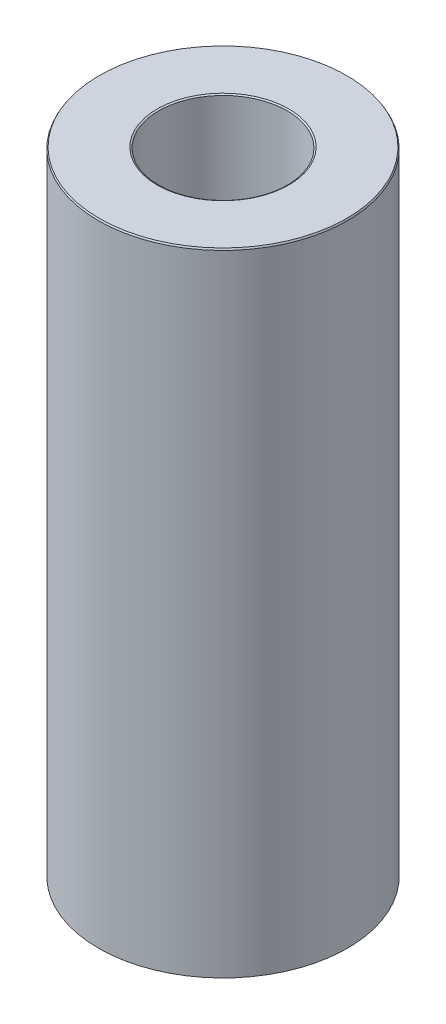
ISO-10303-21;
HEADER;
FILE_DESCRIPTION(('STEP AP214'),'2;1');
FILE_NAME('part.step','',(''),(''),'','','');
FILE_SCHEMA(('AUTOMOTIVE_DESIGN { 1 0 10303 214 1 1 1 1 }'));
ENDSEC;
DATA;
#1=APPLICATION_CONTEXT('core data for automotive mechanical design processes');
#2=APPLICATION_PROTOCOL_DEFINITION('international standard','automotive_design',2000,#1);
#3=PRODUCT_CONTEXT('',#1,'mechanical');
#4=PRODUCT('Part','Part','',(#3));
#5=PRODUCT_RELATED_PRODUCT_CATEGORY('part','',(#4));
#6=PRODUCT_DEFINITION_FORMATION('','',#4);
#7=PRODUCT_DEFINITION_CONTEXT('part definition',#1,'design');
#8=PRODUCT_DEFINITION('design','',#6,#7);
#9=PRODUCT_DEFINITION_SHAPE('','',#8);
#10=(LENGTH_UNIT() NAMED_UNIT(*) SI_UNIT(.MILLI.,.METRE.));
#11=(NAMED_UNIT(*) PLANE_ANGLE_UNIT() SI_UNIT($,.RADIAN.));
#12=(NAMED_UNIT(*) SI_UNIT($,.STERADIAN.) SOLID_ANGLE_UNIT());
#13=UNCERTAINTY_MEASURE_WITH_UNIT(LENGTH_MEASURE(1.E-05),#10,'distance_accuracy_value','');
#14=(GEOMETRIC_REPRESENTATION_CONTEXT(3) GLOBAL_UNCERTAINTY_ASSIGNED_CONTEXT((#13)) GLOBAL_UNIT_ASSIGNED_CONTEXT((#10,
#11,#12)) REPRESENTATION_CONTEXT('',''));
#15=CARTESIAN_POINT('',(0.,0.,0.));
#16=DIRECTION('',(0.,0.,1.));
#17=DIRECTION('',(1.,0.,0.));
#18=AXIS2_PLACEMENT_3D('',#15,#16,#17);
#19=CARTESIAN_POINT('',(0.,177.647973817845,0.));
#20=DIRECTION('',(0.,-1.,0.));
#21=DIRECTION('',(0.,0.,-1.));
#22=AXIS2_PLACEMENT_3D('',#19,#20,#21);
#23=CYLINDRICAL_SURFACE('',#22,35.);
#24=CARTESIAN_POINT('',(0.,0.248312626181579,0.));
#25=DIRECTION('',(0.,1.,0.));
#26=DIRECTION('',(0.,0.,1.));
#27=AXIS2_PLACEMENT_3D('',#24,#25,#26);
#28=CIRCLE('',#27,35.);
#29=CARTESIAN_POINT('',(0.,0.248312626181579,35.));
#30=VERTEX_POINT('',#29);
#31=EDGE_CURVE('E10',#30,#30,#28,.T.);
#32=ORIENTED_EDGE('',*,*,#31,.T.);
#33=EDGE_LOOP('',(#32));
#34=FACE_BOUND('',#33,.T.);
#35=CARTESIAN_POINT('',(0.,177.217883733138,0.));
#36=DIRECTION('',(0.,1.,0.));
#37=DIRECTION('',(0.,0.,1.));
#38=AXIS2_PLACEMENT_3D('',#35,#36,#37);
#39=CIRCLE('',#38,35.);
#40=CARTESIAN_POINT('',(0.,177.217883733138,35.));
#41=VERTEX_POINT('',#40);
#42=EDGE_CURVE('E50',#41,#41,#39,.F.);
#43=ORIENTED_EDGE('',*,*,#42,.T.);
#44=EDGE_LOOP('',(#43));
#45=FACE_BOUND('',#44,.T.);
#46=ADVANCED_FACE('F39',(#34,#45),#23,.T.);
#47=CARTESIAN_POINT('',(0.,177.647973817845,0.));
#48=DIRECTION('',(0.,1.,0.));
#49=DIRECTION('',(0.,0.,1.));
#50=AXIS2_PLACEMENT_3D('',#47,#48,#49);
#51=PLANE('',#50);
#52=CARTESIAN_POINT('',(0.,177.647973817845,0.));
#53=DIRECTION('',(0.,1.,0.));
#54=DIRECTION('',(0.,0.,1.));
#55=AXIS2_PLACEMENT_3D('',#52,#53,#54);
#56=CIRCLE('',#55,18.5058629531211);
#57=CARTESIAN_POINT('',(0.,177.647973817845,18.5058629531211));
#58=VERTEX_POINT('',#57);
#59=EDGE_CURVE('E58',#58,#58,#56,.F.);
#60=ORIENTED_EDGE('',*,*,#59,.T.);
#61=EDGE_LOOP('',(#60));
#62=FACE_BOUND('',#61,.T.);
#63=CARTESIAN_POINT('',(0.,177.647973817845,0.));
#64=DIRECTION('',(0.,1.,0.));
#65=DIRECTION('',(0.,0.,1.));
#66=AXIS2_PLACEMENT_3D('',#63,#64,#65);
#67=CIRCLE('',#66,34.7516873738184);
#68=CARTESIAN_POINT('',(0.,177.647973817845,34.7516873738184));
#69=VERTEX_POINT('',#68);
#70=EDGE_CURVE('E61',#69,#69,#67,.T.);
#71=ORIENTED_EDGE('',*,*,#70,.T.);
#72=EDGE_LOOP('',(#71));
#73=FACE_BOUND('',#72,.T.);
#74=ADVANCED_FACE('F88',(#62,#73),#51,.T.);
#75=CARTESIAN_POINT('',(0.,0.,0.));
#76=DIRECTION('',(0.,1.,0.));
#77=DIRECTION('',(0.,0.,1.));
#78=AXIS2_PLACEMENT_3D('',#75,#76,#77);
#79=PLANE('',#78);
#80=CARTESIAN_POINT('',(0.,0.,0.));
#81=DIRECTION('',(0.,1.,0.));
#82=DIRECTION('',(0.,0.,1.));
#83=AXIS2_PLACEMENT_3D('',#80,#81,#82);
#84=CIRCLE('',#83,18.3240854945952);
#85=CARTESIAN_POINT('',(0.,0.,18.3240854945952));
#86=VERTEX_POINT('',#85);
#87=EDGE_CURVE('E51',#86,#86,#84,.T.);
#88=ORIENTED_EDGE('',*,*,#87,.T.);
#89=EDGE_LOOP('',(#88));
#90=FACE_BOUND('',#89,.T.);
#91=CARTESIAN_POINT('',(0.,0.,0.));
#92=DIRECTION('',(0.,1.,0.));
#93=DIRECTION('',(0.,0.,1.));
#94=AXIS2_PLACEMENT_3D('',#91,#92,#93);
#95=CIRCLE('',#94,34.5699099152926);
#96=CARTESIAN_POINT('',(0.,0.,34.5699099152926));
#97=VERTEX_POINT('',#96);
#98=EDGE_CURVE('E54',#97,#97,#95,.F.);
#99=ORIENTED_EDGE('',*,*,#98,.T.);
#100=EDGE_LOOP('',(#99));
#101=FACE_BOUND('',#100,.T.);
#102=ADVANCED_FACE('F83',(#90,#101),#79,.F.);
#103=CARTESIAN_POINT('',(0.,177.647973817845,0.));
#104=DIRECTION('',(0.,-1.,0.));
#105=DIRECTION('',(0.,0.,-1.));
#106=AXIS2_PLACEMENT_3D('',#103,#104,#105);
#107=CYLINDRICAL_SURFACE('',#106,18.0757728684136);
#108=CARTESIAN_POINT('',(0.,177.399661191664,0.));
#109=DIRECTION('',(0.,1.,0.));
#110=DIRECTION('',(0.,0.,1.));
#111=AXIS2_PLACEMENT_3D('',#108,#109,#110);
#112=CIRCLE('',#111,18.0757728684136);
#113=CARTESIAN_POINT('',(0.,177.399661191664,18.0757728684136));
#114=VERTEX_POINT('',#113);
#115=EDGE_CURVE('E67',#114,#114,#112,.T.);
#116=ORIENTED_EDGE('',*,*,#115,.T.);
#117=EDGE_LOOP('',(#116));
#118=FACE_BOUND('',#117,.T.);
#119=CARTESIAN_POINT('',(0.,0.430090084707374,0.));
#120=DIRECTION('',(0.,1.,0.));
#121=DIRECTION('',(0.,0.,1.));
#122=AXIS2_PLACEMENT_3D('',#119,#120,#121);
#123=CIRCLE('',#122,18.0757728684136);
#124=CARTESIAN_POINT('',(0.,0.430090084707374,18.0757728684136));
#125=VERTEX_POINT('',#124);
#126=EDGE_CURVE('E69',#125,#125,#123,.F.);
#127=ORIENTED_EDGE('',*,*,#126,.T.);
#128=EDGE_LOOP('',(#127));
#129=FACE_BOUND('',#128,.T.);
#130=ADVANCED_FACE('F71',(#118,#129),#107,.F.);
#131=CARTESIAN_POINT('',(0.,177.399661191664,0.));
#132=DIRECTION('',(0.,1.,0.));
#133=DIRECTION('',(0.,0.,1.));
#134=AXIS2_PLACEMENT_3D('',#131,#132,#133);
#135=CONICAL_SURFACE('',#134,18.0757728684136,1.04719755119658);
#136=ORIENTED_EDGE('',*,*,#59,.F.);
#137=EDGE_LOOP('',(#136));
#138=FACE_BOUND('',#137,.T.);
#139=ORIENTED_EDGE('',*,*,#115,.F.);
#140=EDGE_LOOP('',(#139));
#141=FACE_BOUND('',#140,.T.);
#142=ADVANCED_FACE('F77',(#138,#141),#135,.F.);
#143=CARTESIAN_POINT('',(0.,0.,0.));
#144=DIRECTION('',(0.,-1.,0.));
#145=DIRECTION('',(0.,0.,-1.));
#146=AXIS2_PLACEMENT_3D('',#143,#144,#145);
#147=CONICAL_SURFACE('',#146,18.3240854945952,0.52359877559829);
#148=ORIENTED_EDGE('',*,*,#126,.F.);
#149=EDGE_LOOP('',(#148));
#150=FACE_BOUND('',#149,.T.);
#151=ORIENTED_EDGE('',*,*,#87,.F.);
#152=EDGE_LOOP('',(#151));
#153=FACE_BOUND('',#152,.T.);
#154=ADVANCED_FACE('F73',(#150,#153),#147,.F.);
#155=CARTESIAN_POINT('',(0.,0.248312626181579,0.));
#156=DIRECTION('',(0.,1.,0.));
#157=DIRECTION('',(0.,0.,1.));
#158=AXIS2_PLACEMENT_3D('',#155,#156,#157);
#159=CONICAL_SURFACE('',#158,35.,1.04719755119663);
#160=ORIENTED_EDGE('',*,*,#98,.F.);
#161=EDGE_LOOP('',(#160));
#162=FACE_BOUND('',#161,.T.);
#163=ORIENTED_EDGE('',*,*,#31,.F.);
#164=EDGE_LOOP('',(#163));
#165=FACE_BOUND('',#164,.T.);
#166=ADVANCED_FACE('F76',(#162,#165),#159,.T.);
#167=CARTESIAN_POINT('',(0.,177.647973817845,0.));
#168=DIRECTION('',(0.,-1.,0.));
#169=DIRECTION('',(0.,0.,-1.));
#170=AXIS2_PLACEMENT_3D('',#167,#168,#169);
#171=CONICAL_SURFACE('',#170,34.7516873738184,0.523598775598286);
#172=ORIENTED_EDGE('',*,*,#42,.F.);
#173=EDGE_LOOP('',(#172));
#174=FACE_BOUND('',#173,.T.);
#175=ORIENTED_EDGE('',*,*,#70,.F.);
#176=EDGE_LOOP('',(#175));
#177=FACE_BOUND('',#176,.T.);
#178=ADVANCED_FACE('F45',(#174,#177),#171,.T.);
#179=CLOSED_SHELL('',(#46,#74,#102,#130,#142,#154,#166,#178));
#180=MANIFOLD_SOLID_BREP('B2',#179);
#181=ADVANCED_BREP_SHAPE_REPRESENTATION('',(#18,#180),#14);
#182=SHAPE_DEFINITION_REPRESENTATION(#9,#181);
ENDSEC;
END-ISO-10303-21;
